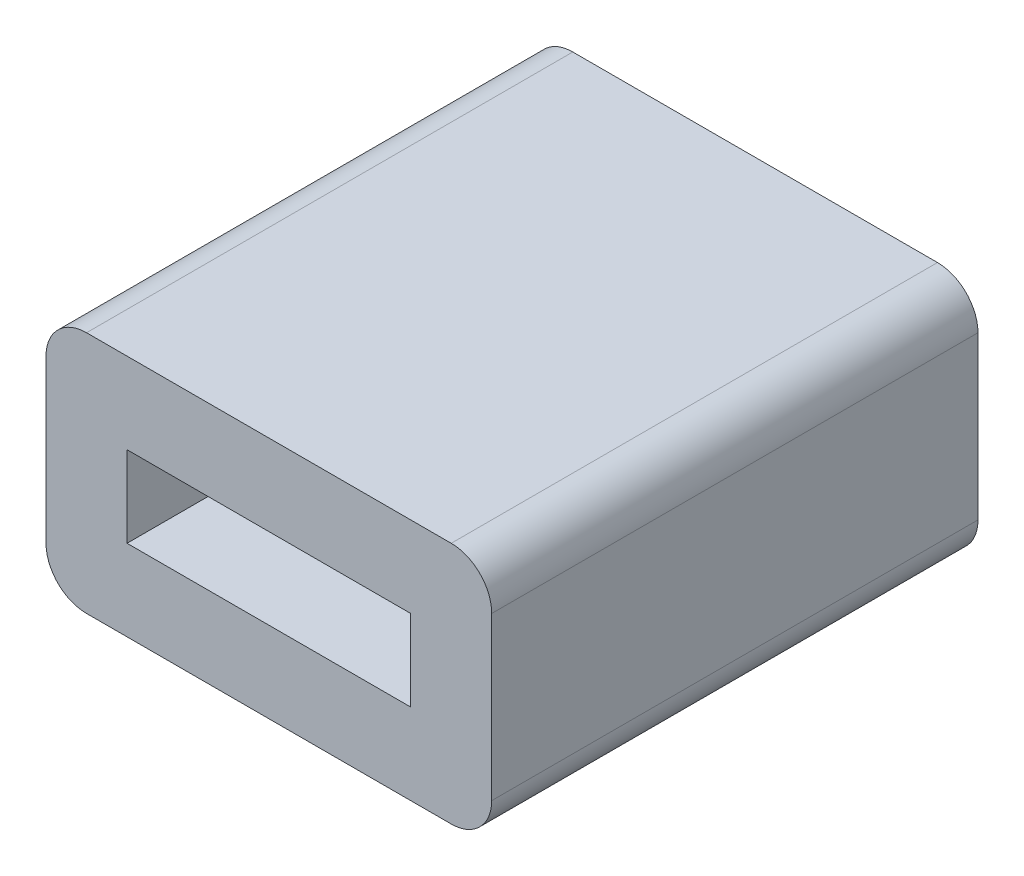
ISO-10303-21;
HEADER;
FILE_DESCRIPTION(('STEP AP214'),'2;1');
FILE_NAME('part.step','',(''),(''),'','','');
FILE_SCHEMA(('AUTOMOTIVE_DESIGN { 1 0 10303 214 1 1 1 1 }'));
ENDSEC;
DATA;
#1=APPLICATION_CONTEXT('core data for automotive mechanical design processes');
#2=APPLICATION_PROTOCOL_DEFINITION('international standard','automotive_design',2000,#1);
#3=PRODUCT_CONTEXT('',#1,'mechanical');
#4=PRODUCT('Part','Part','',(#3));
#5=PRODUCT_RELATED_PRODUCT_CATEGORY('part','',(#4));
#6=PRODUCT_DEFINITION_FORMATION('','',#4);
#7=PRODUCT_DEFINITION_CONTEXT('part definition',#1,'design');
#8=PRODUCT_DEFINITION('design','',#6,#7);
#9=PRODUCT_DEFINITION_SHAPE('','',#8);
#10=(LENGTH_UNIT() NAMED_UNIT(*) SI_UNIT(.MILLI.,.METRE.));
#11=(NAMED_UNIT(*) PLANE_ANGLE_UNIT() SI_UNIT($,.RADIAN.));
#12=(NAMED_UNIT(*) SI_UNIT($,.STERADIAN.) SOLID_ANGLE_UNIT());
#13=UNCERTAINTY_MEASURE_WITH_UNIT(LENGTH_MEASURE(1.E-05),#10,'distance_accuracy_value','');
#14=(GEOMETRIC_REPRESENTATION_CONTEXT(3) GLOBAL_UNCERTAINTY_ASSIGNED_CONTEXT((#13)) GLOBAL_UNIT_ASSIGNED_CONTEXT((#10,
#11,#12)) REPRESENTATION_CONTEXT('',''));
#15=CARTESIAN_POINT('',(0.,0.,0.));
#16=DIRECTION('',(0.,0.,1.));
#17=DIRECTION('',(1.,0.,0.));
#18=AXIS2_PLACEMENT_3D('',#15,#16,#17);
#19=CARTESIAN_POINT('',(-4.5,-2.,12.));
#20=DIRECTION('',(0.,0.,1.));
#21=DIRECTION('',(1.,0.,0.));
#22=AXIS2_PLACEMENT_3D('',#19,#20,#21);
#23=PLANE('',#22);
#24=CARTESIAN_POINT('',(-4.5,-2.,12.));
#25=DIRECTION('',(0.,0.,1.));
#26=DIRECTION('',(1.,0.,0.));
#27=AXIS2_PLACEMENT_3D('',#24,#25,#26);
#28=CIRCLE('',#27,1.);
#29=CARTESIAN_POINT('',(-5.5,-2.,12.));
#30=VERTEX_POINT('',#29);
#31=CARTESIAN_POINT('',(-4.5,-3.,12.));
#32=VERTEX_POINT('',#31);
#33=EDGE_CURVE('E158',#30,#32,#28,.T.);
#34=ORIENTED_EDGE('',*,*,#33,.T.);
#35=DIRECTION('',(1.,0.,0.));
#36=VECTOR('',#35,1.);
#37=CARTESIAN_POINT('',(-4.5,-3.,12.));
#38=LINE('',#37,#36);
#39=CARTESIAN_POINT('',(4.5,-3.,12.));
#40=VERTEX_POINT('',#39);
#41=EDGE_CURVE('E161',#32,#40,#38,.T.);
#42=ORIENTED_EDGE('',*,*,#41,.T.);
#43=CARTESIAN_POINT('',(4.5,-2.,12.));
#44=DIRECTION('',(0.,0.,1.));
#45=DIRECTION('',(1.,0.,0.));
#46=AXIS2_PLACEMENT_3D('',#43,#44,#45);
#47=CIRCLE('',#46,1.);
#48=CARTESIAN_POINT('',(5.5,-2.,12.));
#49=VERTEX_POINT('',#48);
#50=EDGE_CURVE('E164',#40,#49,#47,.T.);
#51=ORIENTED_EDGE('',*,*,#50,.T.);
#52=DIRECTION('',(0.,1.,0.));
#53=VECTOR('',#52,1.);
#54=CARTESIAN_POINT('',(5.5,-2.,12.));
#55=LINE('',#54,#53);
#56=CARTESIAN_POINT('',(5.5,2.,12.));
#57=VERTEX_POINT('',#56);
#58=EDGE_CURVE('E166',#49,#57,#55,.T.);
#59=ORIENTED_EDGE('',*,*,#58,.T.);
#60=CARTESIAN_POINT('',(4.5,2.,12.));
#61=DIRECTION('',(0.,0.,1.));
#62=DIRECTION('',(1.,0.,0.));
#63=AXIS2_PLACEMENT_3D('',#60,#61,#62);
#64=CIRCLE('',#63,1.);
#65=CARTESIAN_POINT('',(4.5,3.,12.));
#66=VERTEX_POINT('',#65);
#67=EDGE_CURVE('E168',#57,#66,#64,.T.);
#68=ORIENTED_EDGE('',*,*,#67,.T.);
#69=DIRECTION('',(-1.,0.,0.));
#70=VECTOR('',#69,1.);
#71=CARTESIAN_POINT('',(-4.5,3.,12.));
#72=LINE('',#71,#70);
#73=CARTESIAN_POINT('',(-4.5,3.,12.));
#74=VERTEX_POINT('',#73);
#75=EDGE_CURVE('E170',#66,#74,#72,.T.);
#76=ORIENTED_EDGE('',*,*,#75,.T.);
#77=CARTESIAN_POINT('',(-4.5,2.,12.));
#78=DIRECTION('',(0.,0.,1.));
#79=DIRECTION('',(-1.,0.,0.));
#80=AXIS2_PLACEMENT_3D('',#77,#78,#79);
#81=CIRCLE('',#80,1.);
#82=CARTESIAN_POINT('',(-5.5,2.,12.));
#83=VERTEX_POINT('',#82);
#84=EDGE_CURVE('E172',#74,#83,#81,.T.);
#85=ORIENTED_EDGE('',*,*,#84,.T.);
#86=DIRECTION('',(0.,-1.,0.));
#87=VECTOR('',#86,1.);
#88=CARTESIAN_POINT('',(-5.5,-2.,12.));
#89=LINE('',#88,#87);
#90=EDGE_CURVE('E174',#83,#30,#89,.T.);
#91=ORIENTED_EDGE('',*,*,#90,.T.);
#92=EDGE_LOOP('',(#34,#42,#51,#59,#68,#76,#85,#91));
#93=FACE_BOUND('',#92,.T.);
#94=DIRECTION('',(-1.,0.,0.));
#95=VECTOR('',#94,1.);
#96=CARTESIAN_POINT('',(-3.5,1.,12.));
#97=LINE('',#96,#95);
#98=CARTESIAN_POINT('',(3.5,1.,12.));
#99=VERTEX_POINT('',#98);
#100=CARTESIAN_POINT('',(-3.5,1.,12.));
#101=VERTEX_POINT('',#100);
#102=EDGE_CURVE('E130',#99,#101,#97,.T.);
#103=ORIENTED_EDGE('',*,*,#102,.F.);
#104=DIRECTION('',(0.,1.,0.));
#105=VECTOR('',#104,1.);
#106=CARTESIAN_POINT('',(3.5,-1.,12.));
#107=LINE('',#106,#105);
#108=CARTESIAN_POINT('',(3.5,-1.,12.));
#109=VERTEX_POINT('',#108);
#110=EDGE_CURVE('E122',#109,#99,#107,.T.);
#111=ORIENTED_EDGE('',*,*,#110,.F.);
#112=DIRECTION('',(1.,0.,0.));
#113=VECTOR('',#112,1.);
#114=CARTESIAN_POINT('',(-3.5,-1.,12.));
#115=LINE('',#114,#113);
#116=CARTESIAN_POINT('',(-3.5,-1.,12.));
#117=VERTEX_POINT('',#116);
#118=EDGE_CURVE('E144',#117,#109,#115,.T.);
#119=ORIENTED_EDGE('',*,*,#118,.F.);
#120=DIRECTION('',(0.,-1.,0.));
#121=VECTOR('',#120,1.);
#122=CARTESIAN_POINT('',(-3.5,-1.,12.));
#123=LINE('',#122,#121);
#124=EDGE_CURVE('E142',#101,#117,#123,.T.);
#125=ORIENTED_EDGE('',*,*,#124,.F.);
#126=EDGE_LOOP('',(#103,#111,#119,#125));
#127=FACE_BOUND('',#126,.T.);
#128=ADVANCED_FACE('F33',(#93,#127),#23,.T.);
#129=CARTESIAN_POINT('',(-4.5,-2.,0.));
#130=DIRECTION('',(0.,0.,1.));
#131=DIRECTION('',(1.,0.,0.));
#132=AXIS2_PLACEMENT_3D('',#129,#130,#131);
#133=PLANE('',#132);
#134=CARTESIAN_POINT('',(-4.5,-2.,0.));
#135=DIRECTION('',(0.,0.,1.));
#136=DIRECTION('',(1.,0.,0.));
#137=AXIS2_PLACEMENT_3D('',#134,#135,#136);
#138=CIRCLE('',#137,1.);
#139=CARTESIAN_POINT('',(-5.5,-2.,0.));
#140=VERTEX_POINT('',#139);
#141=CARTESIAN_POINT('',(-4.5,-3.,0.));
#142=VERTEX_POINT('',#141);
#143=EDGE_CURVE('E138',#140,#142,#138,.T.);
#144=ORIENTED_EDGE('',*,*,#143,.F.);
#145=DIRECTION('',(0.,-1.,0.));
#146=VECTOR('',#145,1.);
#147=CARTESIAN_POINT('',(-5.5,-2.,0.));
#148=LINE('',#147,#146);
#149=CARTESIAN_POINT('',(-5.5,2.,0.));
#150=VERTEX_POINT('',#149);
#151=EDGE_CURVE('E162',#150,#140,#148,.T.);
#152=ORIENTED_EDGE('',*,*,#151,.F.);
#153=CARTESIAN_POINT('',(-4.5,2.,0.));
#154=DIRECTION('',(0.,0.,1.));
#155=DIRECTION('',(-1.,0.,0.));
#156=AXIS2_PLACEMENT_3D('',#153,#154,#155);
#157=CIRCLE('',#156,1.);
#158=CARTESIAN_POINT('',(-4.5,3.,0.));
#159=VERTEX_POINT('',#158);
#160=EDGE_CURVE('E189',#159,#150,#157,.T.);
#161=ORIENTED_EDGE('',*,*,#160,.F.);
#162=DIRECTION('',(-1.,0.,0.));
#163=VECTOR('',#162,1.);
#164=CARTESIAN_POINT('',(-4.5,3.,0.));
#165=LINE('',#164,#163);
#166=CARTESIAN_POINT('',(4.5,3.,0.));
#167=VERTEX_POINT('',#166);
#168=EDGE_CURVE('E187',#167,#159,#165,.T.);
#169=ORIENTED_EDGE('',*,*,#168,.F.);
#170=CARTESIAN_POINT('',(4.5,2.,0.));
#171=DIRECTION('',(0.,0.,1.));
#172=DIRECTION('',(1.,0.,0.));
#173=AXIS2_PLACEMENT_3D('',#170,#171,#172);
#174=CIRCLE('',#173,1.);
#175=CARTESIAN_POINT('',(5.5,2.,0.));
#176=VERTEX_POINT('',#175);
#177=EDGE_CURVE('E185',#176,#167,#174,.T.);
#178=ORIENTED_EDGE('',*,*,#177,.F.);
#179=DIRECTION('',(0.,1.,0.));
#180=VECTOR('',#179,1.);
#181=CARTESIAN_POINT('',(5.5,-2.,0.));
#182=LINE('',#181,#180);
#183=CARTESIAN_POINT('',(5.5,-2.,0.));
#184=VERTEX_POINT('',#183);
#185=EDGE_CURVE('E183',#184,#176,#182,.T.);
#186=ORIENTED_EDGE('',*,*,#185,.F.);
#187=CARTESIAN_POINT('',(4.5,-2.,0.));
#188=DIRECTION('',(0.,0.,1.));
#189=DIRECTION('',(1.,0.,0.));
#190=AXIS2_PLACEMENT_3D('',#187,#188,#189);
#191=CIRCLE('',#190,1.);
#192=CARTESIAN_POINT('',(4.5,-3.,0.));
#193=VERTEX_POINT('',#192);
#194=EDGE_CURVE('E181',#193,#184,#191,.T.);
#195=ORIENTED_EDGE('',*,*,#194,.F.);
#196=DIRECTION('',(1.,0.,0.));
#197=VECTOR('',#196,1.);
#198=CARTESIAN_POINT('',(-4.5,-3.,0.));
#199=LINE('',#198,#197);
#200=EDGE_CURVE('E179',#142,#193,#199,.T.);
#201=ORIENTED_EDGE('',*,*,#200,.F.);
#202=EDGE_LOOP('',(#144,#152,#161,#169,#178,#186,#195,#201));
#203=FACE_BOUND('',#202,.T.);
#204=DIRECTION('',(0.,1.,0.));
#205=VECTOR('',#204,1.);
#206=CARTESIAN_POINT('',(3.5,-1.,0.));
#207=LINE('',#206,#205);
#208=CARTESIAN_POINT('',(3.5,-1.,0.));
#209=VERTEX_POINT('',#208);
#210=CARTESIAN_POINT('',(3.5,1.,0.));
#211=VERTEX_POINT('',#210);
#212=EDGE_CURVE('E56',#209,#211,#207,.T.);
#213=ORIENTED_EDGE('',*,*,#212,.T.);
#214=DIRECTION('',(-1.,0.,0.));
#215=VECTOR('',#214,1.);
#216=CARTESIAN_POINT('',(-3.5,1.,0.));
#217=LINE('',#216,#215);
#218=CARTESIAN_POINT('',(-3.5,1.,0.));
#219=VERTEX_POINT('',#218);
#220=EDGE_CURVE('E137',#211,#219,#217,.T.);
#221=ORIENTED_EDGE('',*,*,#220,.T.);
#222=DIRECTION('',(0.,-1.,0.));
#223=VECTOR('',#222,1.);
#224=CARTESIAN_POINT('',(-3.5,-1.,0.));
#225=LINE('',#224,#223);
#226=CARTESIAN_POINT('',(-3.5,-1.,0.));
#227=VERTEX_POINT('',#226);
#228=EDGE_CURVE('E150',#219,#227,#225,.T.);
#229=ORIENTED_EDGE('',*,*,#228,.T.);
#230=DIRECTION('',(1.,0.,0.));
#231=VECTOR('',#230,1.);
#232=CARTESIAN_POINT('',(-3.5,-1.,0.));
#233=LINE('',#232,#231);
#234=EDGE_CURVE('E131',#227,#209,#233,.T.);
#235=ORIENTED_EDGE('',*,*,#234,.T.);
#236=EDGE_LOOP('',(#213,#221,#229,#235));
#237=FACE_BOUND('',#236,.T.);
#238=ADVANCED_FACE('F219',(#203,#237),#133,.F.);
#239=CARTESIAN_POINT('',(-4.5,-2.,12.));
#240=DIRECTION('',(0.,0.,-1.));
#241=DIRECTION('',(-1.,0.,0.));
#242=AXIS2_PLACEMENT_3D('',#239,#240,#241);
#243=CYLINDRICAL_SURFACE('',#242,1.);
#244=ORIENTED_EDGE('',*,*,#143,.T.);
#245=DIRECTION('',(0.,0.,-1.));
#246=VECTOR('',#245,1.);
#247=CARTESIAN_POINT('',(-4.5,-3.,12.));
#248=LINE('',#247,#246);
#249=EDGE_CURVE('E11',#32,#142,#248,.T.);
#250=ORIENTED_EDGE('',*,*,#249,.F.);
#251=ORIENTED_EDGE('',*,*,#33,.F.);
#252=DIRECTION('',(0.,0.,-1.));
#253=VECTOR('',#252,1.);
#254=CARTESIAN_POINT('',(-5.5,-2.,12.));
#255=LINE('',#254,#253);
#256=EDGE_CURVE('E176',#30,#140,#255,.T.);
#257=ORIENTED_EDGE('',*,*,#256,.T.);
#258=EDGE_LOOP('',(#244,#250,#251,#257));
#259=FACE_BOUND('',#258,.T.);
#260=ADVANCED_FACE('F35',(#259),#243,.T.);
#261=CARTESIAN_POINT('',(-4.5,-3.,12.));
#262=DIRECTION('',(0.,1.,0.));
#263=DIRECTION('',(0.,0.,1.));
#264=AXIS2_PLACEMENT_3D('',#261,#262,#263);
#265=PLANE('',#264);
#266=ORIENTED_EDGE('',*,*,#200,.T.);
#267=DIRECTION('',(0.,0.,-1.));
#268=VECTOR('',#267,1.);
#269=CARTESIAN_POINT('',(4.5,-3.,12.));
#270=LINE('',#269,#268);
#271=EDGE_CURVE('E41',#40,#193,#270,.T.);
#272=ORIENTED_EDGE('',*,*,#271,.F.);
#273=ORIENTED_EDGE('',*,*,#41,.F.);
#274=ORIENTED_EDGE('',*,*,#249,.T.);
#275=EDGE_LOOP('',(#266,#272,#273,#274));
#276=FACE_BOUND('',#275,.T.);
#277=ADVANCED_FACE('F236',(#276),#265,.F.);
#278=CARTESIAN_POINT('',(4.5,-2.,12.));
#279=DIRECTION('',(0.,0.,-1.));
#280=DIRECTION('',(-1.,0.,0.));
#281=AXIS2_PLACEMENT_3D('',#278,#279,#280);
#282=CYLINDRICAL_SURFACE('',#281,1.);
#283=ORIENTED_EDGE('',*,*,#194,.T.);
#284=DIRECTION('',(0.,0.,-1.));
#285=VECTOR('',#284,1.);
#286=CARTESIAN_POINT('',(5.5,-2.,12.));
#287=LINE('',#286,#285);
#288=EDGE_CURVE('E206',#49,#184,#287,.T.);
#289=ORIENTED_EDGE('',*,*,#288,.F.);
#290=ORIENTED_EDGE('',*,*,#50,.F.);
#291=ORIENTED_EDGE('',*,*,#271,.T.);
#292=EDGE_LOOP('',(#283,#289,#290,#291));
#293=FACE_BOUND('',#292,.T.);
#294=ADVANCED_FACE('F213',(#293),#282,.T.);
#295=CARTESIAN_POINT('',(5.5,-2.,12.));
#296=DIRECTION('',(-1.,0.,0.));
#297=DIRECTION('',(0.,0.,1.));
#298=AXIS2_PLACEMENT_3D('',#295,#296,#297);
#299=PLANE('',#298);
#300=ORIENTED_EDGE('',*,*,#185,.T.);
#301=DIRECTION('',(0.,0.,-1.));
#302=VECTOR('',#301,1.);
#303=CARTESIAN_POINT('',(5.5,2.,12.));
#304=LINE('',#303,#302);
#305=EDGE_CURVE('E203',#57,#176,#304,.T.);
#306=ORIENTED_EDGE('',*,*,#305,.F.);
#307=ORIENTED_EDGE('',*,*,#58,.F.);
#308=ORIENTED_EDGE('',*,*,#288,.T.);
#309=EDGE_LOOP('',(#300,#306,#307,#308));
#310=FACE_BOUND('',#309,.T.);
#311=ADVANCED_FACE('F225',(#310),#299,.F.);
#312=CARTESIAN_POINT('',(4.5,2.,12.));
#313=DIRECTION('',(0.,0.,-1.));
#314=DIRECTION('',(-1.,0.,0.));
#315=AXIS2_PLACEMENT_3D('',#312,#313,#314);
#316=CYLINDRICAL_SURFACE('',#315,1.);
#317=ORIENTED_EDGE('',*,*,#177,.T.);
#318=DIRECTION('',(0.,0.,-1.));
#319=VECTOR('',#318,1.);
#320=CARTESIAN_POINT('',(4.5,3.,12.));
#321=LINE('',#320,#319);
#322=EDGE_CURVE('E200',#66,#167,#321,.T.);
#323=ORIENTED_EDGE('',*,*,#322,.F.);
#324=ORIENTED_EDGE('',*,*,#67,.F.);
#325=ORIENTED_EDGE('',*,*,#305,.T.);
#326=EDGE_LOOP('',(#317,#323,#324,#325));
#327=FACE_BOUND('',#326,.T.);
#328=ADVANCED_FACE('F229',(#327),#316,.T.);
#329=CARTESIAN_POINT('',(-4.5,3.,12.));
#330=DIRECTION('',(0.,-1.,0.));
#331=DIRECTION('',(0.,0.,-1.));
#332=AXIS2_PLACEMENT_3D('',#329,#330,#331);
#333=PLANE('',#332);
#334=ORIENTED_EDGE('',*,*,#168,.T.);
#335=DIRECTION('',(0.,0.,-1.));
#336=VECTOR('',#335,1.);
#337=CARTESIAN_POINT('',(-4.5,3.,12.));
#338=LINE('',#337,#336);
#339=EDGE_CURVE('E197',#74,#159,#338,.T.);
#340=ORIENTED_EDGE('',*,*,#339,.F.);
#341=ORIENTED_EDGE('',*,*,#75,.F.);
#342=ORIENTED_EDGE('',*,*,#322,.T.);
#343=EDGE_LOOP('',(#334,#340,#341,#342));
#344=FACE_BOUND('',#343,.T.);
#345=ADVANCED_FACE('F249',(#344),#333,.F.);
#346=CARTESIAN_POINT('',(-4.5,2.,12.));
#347=DIRECTION('',(0.,0.,-1.));
#348=DIRECTION('',(-1.,0.,0.));
#349=AXIS2_PLACEMENT_3D('',#346,#347,#348);
#350=CYLINDRICAL_SURFACE('',#349,1.);
#351=ORIENTED_EDGE('',*,*,#160,.T.);
#352=DIRECTION('',(0.,0.,-1.));
#353=VECTOR('',#352,1.);
#354=CARTESIAN_POINT('',(-5.5,2.,12.));
#355=LINE('',#354,#353);
#356=EDGE_CURVE('E194',#83,#150,#355,.T.);
#357=ORIENTED_EDGE('',*,*,#356,.F.);
#358=ORIENTED_EDGE('',*,*,#84,.F.);
#359=ORIENTED_EDGE('',*,*,#339,.T.);
#360=EDGE_LOOP('',(#351,#357,#358,#359));
#361=FACE_BOUND('',#360,.T.);
#362=ADVANCED_FACE('F247',(#361),#350,.T.);
#363=CARTESIAN_POINT('',(-5.5,-2.,12.));
#364=DIRECTION('',(1.,0.,0.));
#365=DIRECTION('',(0.,0.,-1.));
#366=AXIS2_PLACEMENT_3D('',#363,#364,#365);
#367=PLANE('',#366);
#368=ORIENTED_EDGE('',*,*,#151,.T.);
#369=ORIENTED_EDGE('',*,*,#256,.F.);
#370=ORIENTED_EDGE('',*,*,#90,.F.);
#371=ORIENTED_EDGE('',*,*,#356,.T.);
#372=EDGE_LOOP('',(#368,#369,#370,#371));
#373=FACE_BOUND('',#372,.T.);
#374=ADVANCED_FACE('F242',(#373),#367,.F.);
#375=CARTESIAN_POINT('',(3.5,-1.,12.));
#376=DIRECTION('',(-1.,0.,0.));
#377=DIRECTION('',(0.,0.,1.));
#378=AXIS2_PLACEMENT_3D('',#375,#376,#377);
#379=PLANE('',#378);
#380=ORIENTED_EDGE('',*,*,#212,.F.);
#381=DIRECTION('',(0.,0.,-1.));
#382=VECTOR('',#381,1.);
#383=CARTESIAN_POINT('',(3.5,-1.,12.));
#384=LINE('',#383,#382);
#385=EDGE_CURVE('E126',#109,#209,#384,.T.);
#386=ORIENTED_EDGE('',*,*,#385,.F.);
#387=ORIENTED_EDGE('',*,*,#110,.T.);
#388=DIRECTION('',(0.,0.,-1.));
#389=VECTOR('',#388,1.);
#390=CARTESIAN_POINT('',(3.5,1.,12.));
#391=LINE('',#390,#389);
#392=EDGE_CURVE('E125',#99,#211,#391,.T.);
#393=ORIENTED_EDGE('',*,*,#392,.T.);
#394=EDGE_LOOP('',(#380,#386,#387,#393));
#395=FACE_BOUND('',#394,.T.);
#396=ADVANCED_FACE('F124',(#395),#379,.T.);
#397=CARTESIAN_POINT('',(-3.5,1.,12.));
#398=DIRECTION('',(0.,-1.,0.));
#399=DIRECTION('',(0.,0.,-1.));
#400=AXIS2_PLACEMENT_3D('',#397,#398,#399);
#401=PLANE('',#400);
#402=ORIENTED_EDGE('',*,*,#220,.F.);
#403=ORIENTED_EDGE('',*,*,#392,.F.);
#404=ORIENTED_EDGE('',*,*,#102,.T.);
#405=DIRECTION('',(0.,0.,-1.));
#406=VECTOR('',#405,1.);
#407=CARTESIAN_POINT('',(-3.5,1.,12.));
#408=LINE('',#407,#406);
#409=EDGE_CURVE('E139',#101,#219,#408,.T.);
#410=ORIENTED_EDGE('',*,*,#409,.T.);
#411=EDGE_LOOP('',(#402,#403,#404,#410));
#412=FACE_BOUND('',#411,.T.);
#413=ADVANCED_FACE('F134',(#412),#401,.T.);
#414=CARTESIAN_POINT('',(-3.5,-1.,12.));
#415=DIRECTION('',(1.,0.,0.));
#416=DIRECTION('',(0.,0.,-1.));
#417=AXIS2_PLACEMENT_3D('',#414,#415,#416);
#418=PLANE('',#417);
#419=ORIENTED_EDGE('',*,*,#228,.F.);
#420=ORIENTED_EDGE('',*,*,#409,.F.);
#421=ORIENTED_EDGE('',*,*,#124,.T.);
#422=DIRECTION('',(0.,0.,-1.));
#423=VECTOR('',#422,1.);
#424=CARTESIAN_POINT('',(-3.5,-1.,12.));
#425=LINE('',#424,#423);
#426=EDGE_CURVE('E48',#117,#227,#425,.T.);
#427=ORIENTED_EDGE('',*,*,#426,.T.);
#428=EDGE_LOOP('',(#419,#420,#421,#427));
#429=FACE_BOUND('',#428,.T.);
#430=ADVANCED_FACE('F274',(#429),#418,.T.);
#431=CARTESIAN_POINT('',(-3.5,-1.,12.));
#432=DIRECTION('',(0.,1.,0.));
#433=DIRECTION('',(0.,0.,1.));
#434=AXIS2_PLACEMENT_3D('',#431,#432,#433);
#435=PLANE('',#434);
#436=ORIENTED_EDGE('',*,*,#234,.F.);
#437=ORIENTED_EDGE('',*,*,#426,.F.);
#438=ORIENTED_EDGE('',*,*,#118,.T.);
#439=ORIENTED_EDGE('',*,*,#385,.T.);
#440=EDGE_LOOP('',(#436,#437,#438,#439));
#441=FACE_BOUND('',#440,.T.);
#442=ADVANCED_FACE('F278',(#441),#435,.T.);
#443=CLOSED_SHELL('',(#128,#238,#260,#277,#294,#311,#328,#345,#362,#374,#396,#413,#430,#442));
#444=MANIFOLD_SOLID_BREP('B2',#443);
#445=ADVANCED_BREP_SHAPE_REPRESENTATION('',(#18,#444),#14);
#446=SHAPE_DEFINITION_REPRESENTATION(#9,#445);
ENDSEC;
END-ISO-10303-21;
